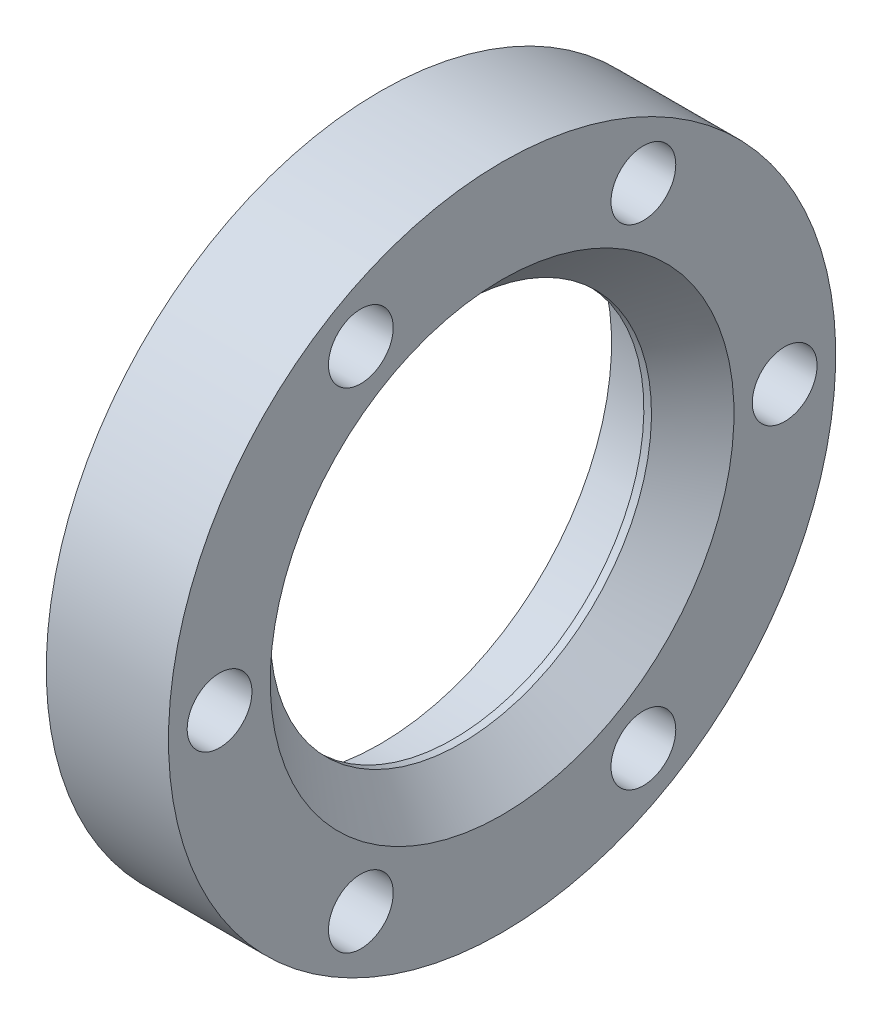
ISO-10303-21;
HEADER;
FILE_DESCRIPTION(('STEP AP214'),'2;1');
FILE_NAME('part.step','',(''),(''),'','','');
FILE_SCHEMA(('AUTOMOTIVE_DESIGN { 1 0 10303 214 1 1 1 1 }'));
ENDSEC;
DATA;
#1=APPLICATION_CONTEXT('core data for automotive mechanical design processes');
#2=APPLICATION_PROTOCOL_DEFINITION('international standard','automotive_design',2000,#1);
#3=PRODUCT_CONTEXT('',#1,'mechanical');
#4=PRODUCT('Part','Part','',(#3));
#5=PRODUCT_RELATED_PRODUCT_CATEGORY('part','',(#4));
#6=PRODUCT_DEFINITION_FORMATION('','',#4);
#7=PRODUCT_DEFINITION_CONTEXT('part definition',#1,'design');
#8=PRODUCT_DEFINITION('design','',#6,#7);
#9=PRODUCT_DEFINITION_SHAPE('','',#8);
#10=(LENGTH_UNIT() NAMED_UNIT(*) SI_UNIT(.MILLI.,.METRE.));
#11=(NAMED_UNIT(*) PLANE_ANGLE_UNIT() SI_UNIT($,.RADIAN.));
#12=(NAMED_UNIT(*) SI_UNIT($,.STERADIAN.) SOLID_ANGLE_UNIT());
#13=UNCERTAINTY_MEASURE_WITH_UNIT(LENGTH_MEASURE(1.E-05),#10,'distance_accuracy_value','');
#14=(GEOMETRIC_REPRESENTATION_CONTEXT(3) GLOBAL_UNCERTAINTY_ASSIGNED_CONTEXT((#13)) GLOBAL_UNIT_ASSIGNED_CONTEXT((#10,
#11,#12)) REPRESENTATION_CONTEXT('',''));
#15=CARTESIAN_POINT('',(0.,0.,0.));
#16=DIRECTION('',(0.,0.,1.));
#17=DIRECTION('',(1.,0.,0.));
#18=AXIS2_PLACEMENT_3D('',#15,#16,#17);
#19=CARTESIAN_POINT('',(8.01687499999896,0.,0.));
#20=DIRECTION('',(1.,0.,0.));
#21=DIRECTION('',(0.,1.,0.));
#22=AXIS2_PLACEMENT_3D('',#19,#20,#21);
#23=CYLINDRICAL_SURFACE('',#22,19.8120000000008);
#24=CARTESIAN_POINT('',(8.41374999807562,0.,0.));
#25=DIRECTION('',(1.,0.,0.));
#26=DIRECTION('',(0.,1.,0.));
#27=AXIS2_PLACEMENT_3D('',#24,#25,#26);
#28=CIRCLE('',#27,19.8120000019241);
#29=CARTESIAN_POINT('',(8.41374999807565,19.8120000019241,0.));
#30=VERTEX_POINT('',#29);
#31=EDGE_CURVE('E75',#30,#30,#28,.T.);
#32=ORIENTED_EDGE('',*,*,#31,.T.);
#33=EDGE_LOOP('',(#32));
#34=FACE_BOUND('',#33,.T.);
#35=CARTESIAN_POINT('',(7.61999999999895,0.,0.));
#36=DIRECTION('',(1.,0.,0.));
#37=DIRECTION('',(0.,1.,0.));
#38=AXIS2_PLACEMENT_3D('',#35,#36,#37);
#39=CIRCLE('',#38,19.8120000000008);
#40=CARTESIAN_POINT('',(7.61999999999898,19.8120000000008,0.));
#41=VERTEX_POINT('',#40);
#42=EDGE_CURVE('E18',#41,#41,#39,.T.);
#43=ORIENTED_EDGE('',*,*,#42,.F.);
#44=EDGE_LOOP('',(#43));
#45=FACE_BOUND('',#44,.T.);
#46=ADVANCED_FACE('F14',(#34,#45),#23,.F.);
#47=CARTESIAN_POINT('',(7.61999999999898,21.9437000000006,0.));
#48=DIRECTION('',(-1.,0.,0.));
#49=DIRECTION('',(0.,0.,1.));
#50=AXIS2_PLACEMENT_3D('',#47,#48,#49);
#51=PLANE('',#50);
#52=ORIENTED_EDGE('',*,*,#42,.T.);
#53=EDGE_LOOP('',(#52));
#54=FACE_BOUND('',#53,.T.);
#55=CARTESIAN_POINT('',(7.61999999999894,0.,0.));
#56=DIRECTION('',(1.,0.,0.));
#57=DIRECTION('',(0.,1.,0.));
#58=AXIS2_PLACEMENT_3D('',#55,#56,#57);
#59=CIRCLE('',#58,24.0754000000004);
#60=CARTESIAN_POINT('',(7.61999999999898,24.0754000000004,0.));
#61=VERTEX_POINT('',#60);
#62=EDGE_CURVE('E73',#61,#61,#59,.F.);
#63=ORIENTED_EDGE('',*,*,#62,.T.);
#64=EDGE_LOOP('',(#63));
#65=FACE_BOUND('',#64,.T.);
#66=ADVANCED_FACE('F84',(#54,#65),#51,.T.);
#67=CARTESIAN_POINT('',(12.7000000019235,0.,0.));
#68=DIRECTION('',(1.,0.,0.));
#69=DIRECTION('',(0.,1.,0.));
#70=AXIS2_PLACEMENT_3D('',#67,#68,#69);
#71=CONICAL_SURFACE('',#70,24.0982499980792,0.78539816250007);
#72=CARTESIAN_POINT('',(12.7000000019235,0.,0.));
#73=DIRECTION('',(1.,0.,0.));
#74=DIRECTION('',(0.,1.,0.));
#75=AXIS2_PLACEMENT_3D('',#72,#73,#74);
#76=CIRCLE('',#75,24.0982499980792);
#77=CARTESIAN_POINT('',(12.7000000019235,24.0982499980792,0.));
#78=VERTEX_POINT('',#77);
#79=EDGE_CURVE('E53',#78,#78,#76,.F.);
#80=ORIENTED_EDGE('',*,*,#79,.F.);
#81=EDGE_LOOP('',(#80));
#82=FACE_BOUND('',#81,.T.);
#83=ORIENTED_EDGE('',*,*,#31,.F.);
#84=EDGE_LOOP('',(#83));
#85=FACE_BOUND('',#84,.T.);
#86=ADVANCED_FACE('F94',(#82,#85),#71,.F.);
#87=CARTESIAN_POINT('',(1.240785174E-13,25.4285843160802,-14.6812));
#88=DIRECTION('',(1.,0.,0.));
#89=DIRECTION('',(0.,0.,-1.));
#90=AXIS2_PLACEMENT_3D('',#87,#88,#89);
#91=CYLINDRICAL_SURFACE('',#90,3.36549999999999);
#92=CARTESIAN_POINT('',(1.35358378E-13,25.4285843160802,-14.6812));
#93=DIRECTION('',(1.,0.,0.));
#94=DIRECTION('',(0.,0.,-1.));
#95=AXIS2_PLACEMENT_3D('',#92,#93,#94);
#96=CIRCLE('',#95,3.36549999999999);
#97=CARTESIAN_POINT('',(1.32693040020406E-13,25.4285843160802,-18.0467));
#98=VERTEX_POINT('',#97);
#99=EDGE_CURVE('E50',#98,#98,#96,.T.);
#100=ORIENTED_EDGE('',*,*,#99,.F.);
#101=EDGE_LOOP('',(#100));
#102=FACE_BOUND('',#101,.T.);
#103=CARTESIAN_POINT('',(12.7000000000002,25.4285843160802,-14.6812));
#104=DIRECTION('',(1.,0.,0.));
#105=DIRECTION('',(0.,0.,-1.));
#106=AXIS2_PLACEMENT_3D('',#103,#104,#105);
#107=CIRCLE('',#106,3.36549999999999);
#108=CARTESIAN_POINT('',(12.7000000000002,25.4285843160802,-18.0467));
#109=VERTEX_POINT('',#108);
#110=EDGE_CURVE('E71',#109,#109,#107,.F.);
#111=ORIENTED_EDGE('',*,*,#110,.F.);
#112=EDGE_LOOP('',(#111));
#113=FACE_BOUND('',#112,.T.);
#114=ADVANCED_FACE('F119',(#102,#113),#91,.F.);
#115=CARTESIAN_POINT('',(0.,0.,-29.3624));
#116=DIRECTION('',(1.,0.,0.));
#117=DIRECTION('',(0.,1.,0.));
#118=AXIS2_PLACEMENT_3D('',#115,#116,#117);
#119=CYLINDRICAL_SURFACE('',#118,3.3655);
#120=CARTESIAN_POINT('',(1.35358378E-13,0.,-29.3624));
#121=DIRECTION('',(1.,0.,0.));
#122=DIRECTION('',(0.,1.,0.));
#123=AXIS2_PLACEMENT_3D('',#120,#121,#122);
#124=CIRCLE('',#123,3.3655);
#125=CARTESIAN_POINT('',(1.414547082E-13,3.3655,-29.3624));
#126=VERTEX_POINT('',#125);
#127=EDGE_CURVE('E47',#126,#126,#124,.T.);
#128=ORIENTED_EDGE('',*,*,#127,.F.);
#129=EDGE_LOOP('',(#128));
#130=FACE_BOUND('',#129,.T.);
#131=CARTESIAN_POINT('',(12.7000000000002,0.,-29.3624));
#132=DIRECTION('',(1.,0.,0.));
#133=DIRECTION('',(0.,1.,0.));
#134=AXIS2_PLACEMENT_3D('',#131,#132,#133);
#135=CIRCLE('',#134,3.3655);
#136=CARTESIAN_POINT('',(12.7000000000002,3.36549999999998,-29.3624));
#137=VERTEX_POINT('',#136);
#138=EDGE_CURVE('E68',#137,#137,#135,.F.);
#139=ORIENTED_EDGE('',*,*,#138,.F.);
#140=EDGE_LOOP('',(#139));
#141=FACE_BOUND('',#140,.T.);
#142=ADVANCED_FACE('F125',(#130,#141),#119,.F.);
#143=CARTESIAN_POINT('',(0.,-25.4285843160802,-14.6812));
#144=DIRECTION('',(1.,0.,0.));
#145=DIRECTION('',(0.,0.,-1.));
#146=AXIS2_PLACEMENT_3D('',#143,#144,#145);
#147=CYLINDRICAL_SURFACE('',#146,3.36549999999999);
#148=CARTESIAN_POINT('',(1.35358378E-13,-25.4285843160802,-14.6812));
#149=DIRECTION('',(1.,0.,0.));
#150=DIRECTION('',(0.,0.,-1.));
#151=AXIS2_PLACEMENT_3D('',#148,#149,#150);
#152=CIRCLE('',#151,3.36549999999999);
#153=CARTESIAN_POINT('',(1.38023707180776E-13,-25.4285843160802,-18.0467));
#154=VERTEX_POINT('',#153);
#155=EDGE_CURVE('E44',#154,#154,#152,.T.);
#156=ORIENTED_EDGE('',*,*,#155,.F.);
#157=EDGE_LOOP('',(#156));
#158=FACE_BOUND('',#157,.T.);
#159=CARTESIAN_POINT('',(12.7000000000002,-25.4285843160802,-14.6812));
#160=DIRECTION('',(1.,0.,0.));
#161=DIRECTION('',(0.,0.,-1.));
#162=AXIS2_PLACEMENT_3D('',#159,#160,#161);
#163=CIRCLE('',#162,3.36549999999999);
#164=CARTESIAN_POINT('',(12.7000000000002,-25.4285843160802,-18.0467));
#165=VERTEX_POINT('',#164);
#166=EDGE_CURVE('E65',#165,#165,#163,.F.);
#167=ORIENTED_EDGE('',*,*,#166,.F.);
#168=EDGE_LOOP('',(#167));
#169=FACE_BOUND('',#168,.T.);
#170=ADVANCED_FACE('F146',(#158,#169),#147,.F.);
#171=CARTESIAN_POINT('',(0.,-25.4285843160802,14.6812));
#172=DIRECTION('',(1.,0.,0.));
#173=DIRECTION('',(0.,0.,-1.));
#174=AXIS2_PLACEMENT_3D('',#171,#172,#173);
#175=CYLINDRICAL_SURFACE('',#174,3.36549999999999);
#176=CARTESIAN_POINT('',(1.35358378E-13,-25.4285843160802,14.6812));
#177=DIRECTION('',(1.,0.,0.));
#178=DIRECTION('',(0.,0.,-1.));
#179=AXIS2_PLACEMENT_3D('',#176,#177,#178);
#180=CIRCLE('',#179,3.36549999999999);
#181=CARTESIAN_POINT('',(1.32795231693552E-13,-25.4285843160802,11.3157));
#182=VERTEX_POINT('',#181);
#183=EDGE_CURVE('E41',#182,#182,#180,.T.);
#184=ORIENTED_EDGE('',*,*,#183,.F.);
#185=EDGE_LOOP('',(#184));
#186=FACE_BOUND('',#185,.T.);
#187=CARTESIAN_POINT('',(12.7000000000002,-25.4285843160802,14.6812));
#188=DIRECTION('',(1.,0.,0.));
#189=DIRECTION('',(0.,0.,-1.));
#190=AXIS2_PLACEMENT_3D('',#187,#188,#189);
#191=CIRCLE('',#190,3.36549999999999);
#192=CARTESIAN_POINT('',(12.7000000000002,-25.4285843160802,11.3157));
#193=VERTEX_POINT('',#192);
#194=EDGE_CURVE('E62',#193,#193,#191,.F.);
#195=ORIENTED_EDGE('',*,*,#194,.F.);
#196=EDGE_LOOP('',(#195));
#197=FACE_BOUND('',#196,.T.);
#198=ADVANCED_FACE('F153',(#186,#197),#175,.F.);
#199=CARTESIAN_POINT('',(1.240785174E-13,25.4285843160802,14.6812));
#200=DIRECTION('',(1.,0.,0.));
#201=DIRECTION('',(0.,0.,-1.));
#202=AXIS2_PLACEMENT_3D('',#199,#200,#201);
#203=CYLINDRICAL_SURFACE('',#202,3.36549999999999);
#204=CARTESIAN_POINT('',(1.35358378E-13,25.4285843160802,14.6812));
#205=DIRECTION('',(1.,0.,0.));
#206=DIRECTION('',(0.,0.,-1.));
#207=AXIS2_PLACEMENT_3D('',#204,#205,#206);
#208=CIRCLE('',#207,3.36549999999999);
#209=CARTESIAN_POINT('',(1.37921517707334E-13,25.4285843160802,11.3157));
#210=VERTEX_POINT('',#209);
#211=EDGE_CURVE('E38',#210,#210,#208,.T.);
#212=ORIENTED_EDGE('',*,*,#211,.F.);
#213=EDGE_LOOP('',(#212));
#214=FACE_BOUND('',#213,.T.);
#215=CARTESIAN_POINT('',(12.7000000000002,25.4285843160802,14.6812));
#216=DIRECTION('',(1.,0.,0.));
#217=DIRECTION('',(0.,0.,-1.));
#218=AXIS2_PLACEMENT_3D('',#215,#216,#217);
#219=CIRCLE('',#218,3.36549999999999);
#220=CARTESIAN_POINT('',(12.7000000000002,25.4285843160802,11.3157));
#221=VERTEX_POINT('',#220);
#222=EDGE_CURVE('E59',#221,#221,#219,.F.);
#223=ORIENTED_EDGE('',*,*,#222,.F.);
#224=EDGE_LOOP('',(#223));
#225=FACE_BOUND('',#224,.T.);
#226=ADVANCED_FACE('F159',(#214,#225),#203,.F.);
#227=CARTESIAN_POINT('',(0.,0.,29.3624));
#228=DIRECTION('',(1.,0.,0.));
#229=DIRECTION('',(0.,1.,0.));
#230=AXIS2_PLACEMENT_3D('',#227,#228,#229);
#231=CYLINDRICAL_SURFACE('',#230,3.3655);
#232=CARTESIAN_POINT('',(1.35358378E-13,0.,29.3624));
#233=DIRECTION('',(1.,0.,0.));
#234=DIRECTION('',(0.,1.,0.));
#235=AXIS2_PLACEMENT_3D('',#232,#233,#234);
#236=CIRCLE('',#235,3.3655);
#237=CARTESIAN_POINT('',(1.413366998E-13,3.3655,29.3624));
#238=VERTEX_POINT('',#237);
#239=EDGE_CURVE('E35',#238,#238,#236,.T.);
#240=ORIENTED_EDGE('',*,*,#239,.F.);
#241=EDGE_LOOP('',(#240));
#242=FACE_BOUND('',#241,.T.);
#243=CARTESIAN_POINT('',(12.7000000000002,0.,29.3624));
#244=DIRECTION('',(1.,0.,0.));
#245=DIRECTION('',(0.,1.,0.));
#246=AXIS2_PLACEMENT_3D('',#243,#244,#245);
#247=CIRCLE('',#246,3.3655);
#248=CARTESIAN_POINT('',(12.7000000000002,3.36549999999998,29.3624));
#249=VERTEX_POINT('',#248);
#250=EDGE_CURVE('E56',#249,#249,#247,.F.);
#251=ORIENTED_EDGE('',*,*,#250,.F.);
#252=EDGE_LOOP('',(#251));
#253=FACE_BOUND('',#252,.T.);
#254=ADVANCED_FACE('F16',(#242,#253),#231,.F.);
#255=CARTESIAN_POINT('',(3.80999999999952,0.,0.));
#256=DIRECTION('',(1.,0.,0.));
#257=DIRECTION('',(0.,1.,0.));
#258=AXIS2_PLACEMENT_3D('',#255,#256,#257);
#259=CYLINDRICAL_SURFACE('',#258,24.0754000000004);
#260=ORIENTED_EDGE('',*,*,#62,.F.);
#261=EDGE_LOOP('',(#260));
#262=FACE_BOUND('',#261,.T.);
#263=CARTESIAN_POINT('',(0.,0.,0.));
#264=DIRECTION('',(1.,0.,0.));
#265=DIRECTION('',(0.,1.,0.));
#266=AXIS2_PLACEMENT_3D('',#263,#264,#265);
#267=CIRCLE('',#266,24.0754000000004);
#268=CARTESIAN_POINT('',(1.35140530413566E-13,24.0754000000004,0.));
#269=VERTEX_POINT('',#268);
#270=EDGE_CURVE('E27',#269,#269,#267,.T.);
#271=ORIENTED_EDGE('',*,*,#270,.F.);
#272=EDGE_LOOP('',(#271));
#273=FACE_BOUND('',#272,.T.);
#274=ADVANCED_FACE('F113',(#262,#273),#259,.F.);
#275=CARTESIAN_POINT('',(12.7000000000002,29.3846250000013,0.));
#276=DIRECTION('',(1.,0.,0.));
#277=DIRECTION('',(0.,0.,-1.));
#278=AXIS2_PLACEMENT_3D('',#275,#276,#277);
#279=PLANE('',#278);
#280=ORIENTED_EDGE('',*,*,#79,.T.);
#281=EDGE_LOOP('',(#280));
#282=FACE_BOUND('',#281,.T.);
#283=ORIENTED_EDGE('',*,*,#250,.T.);
#284=EDGE_LOOP('',(#283));
#285=FACE_BOUND('',#284,.T.);
#286=ORIENTED_EDGE('',*,*,#222,.T.);
#287=EDGE_LOOP('',(#286));
#288=FACE_BOUND('',#287,.T.);
#289=ORIENTED_EDGE('',*,*,#194,.T.);
#290=EDGE_LOOP('',(#289));
#291=FACE_BOUND('',#290,.T.);
#292=ORIENTED_EDGE('',*,*,#166,.T.);
#293=EDGE_LOOP('',(#292));
#294=FACE_BOUND('',#293,.T.);
#295=ORIENTED_EDGE('',*,*,#138,.T.);
#296=EDGE_LOOP('',(#295));
#297=FACE_BOUND('',#296,.T.);
#298=ORIENTED_EDGE('',*,*,#110,.T.);
#299=EDGE_LOOP('',(#298));
#300=FACE_BOUND('',#299,.T.);
#301=CARTESIAN_POINT('',(12.7000000000001,0.,0.));
#302=DIRECTION('',(1.,0.,0.));
#303=DIRECTION('',(0.,1.,0.));
#304=AXIS2_PLACEMENT_3D('',#301,#302,#303);
#305=CIRCLE('',#304,34.6710000000002);
#306=CARTESIAN_POINT('',(12.7000000000002,34.6710000000002,0.));
#307=VERTEX_POINT('',#306);
#308=EDGE_CURVE('E22',#307,#307,#305,.F.);
#309=ORIENTED_EDGE('',*,*,#308,.F.);
#310=EDGE_LOOP('',(#309));
#311=FACE_BOUND('',#310,.T.);
#312=ADVANCED_FACE('F106',(#282,#285,#288,#291,#294,#297,#300,#311),#279,.T.);
#313=CARTESIAN_POINT('',(1.35358378E-13,29.3732000000003,0.));
#314=DIRECTION('',(-1.,0.,0.));
#315=DIRECTION('',(0.,0.,1.));
#316=AXIS2_PLACEMENT_3D('',#313,#314,#315);
#317=PLANE('',#316);
#318=ORIENTED_EDGE('',*,*,#270,.T.);
#319=EDGE_LOOP('',(#318));
#320=FACE_BOUND('',#319,.T.);
#321=ORIENTED_EDGE('',*,*,#239,.T.);
#322=EDGE_LOOP('',(#321));
#323=FACE_BOUND('',#322,.T.);
#324=ORIENTED_EDGE('',*,*,#211,.T.);
#325=EDGE_LOOP('',(#324));
#326=FACE_BOUND('',#325,.T.);
#327=ORIENTED_EDGE('',*,*,#183,.T.);
#328=EDGE_LOOP('',(#327));
#329=FACE_BOUND('',#328,.T.);
#330=ORIENTED_EDGE('',*,*,#155,.T.);
#331=EDGE_LOOP('',(#330));
#332=FACE_BOUND('',#331,.T.);
#333=ORIENTED_EDGE('',*,*,#127,.T.);
#334=EDGE_LOOP('',(#333));
#335=FACE_BOUND('',#334,.T.);
#336=ORIENTED_EDGE('',*,*,#99,.T.);
#337=EDGE_LOOP('',(#336));
#338=FACE_BOUND('',#337,.T.);
#339=CARTESIAN_POINT('',(0.,0.,0.));
#340=DIRECTION('',(1.,0.,0.));
#341=DIRECTION('',(0.,1.,0.));
#342=AXIS2_PLACEMENT_3D('',#339,#340,#341);
#343=CIRCLE('',#342,34.6710000000002);
#344=CARTESIAN_POINT('',(1.35313821276015E-13,34.6710000000002,0.));
#345=VERTEX_POINT('',#344);
#346=EDGE_CURVE('E10',#345,#345,#343,.T.);
#347=ORIENTED_EDGE('',*,*,#346,.F.);
#348=EDGE_LOOP('',(#347));
#349=FACE_BOUND('',#348,.T.);
#350=ADVANCED_FACE('F99',(#320,#323,#326,#329,#332,#335,#338,#349),#317,.T.);
#351=CARTESIAN_POINT('',(6.3500000000001,0.,0.));
#352=DIRECTION('',(1.,0.,0.));
#353=DIRECTION('',(0.,1.,0.));
#354=AXIS2_PLACEMENT_3D('',#351,#352,#353);
#355=CYLINDRICAL_SURFACE('',#354,34.6710000000002);
#356=ORIENTED_EDGE('',*,*,#346,.T.);
#357=EDGE_LOOP('',(#356));
#358=FACE_BOUND('',#357,.T.);
#359=ORIENTED_EDGE('',*,*,#308,.T.);
#360=EDGE_LOOP('',(#359));
#361=FACE_BOUND('',#360,.T.);
#362=ADVANCED_FACE('F97',(#358,#361),#355,.T.);
#363=CLOSED_SHELL('',(#46,#66,#86,#114,#142,#170,#198,#226,#254,#274,#312,#350,#362));
#364=MANIFOLD_SOLID_BREP('B1',#363);
#365=ADVANCED_BREP_SHAPE_REPRESENTATION('',(#18,#364),#14);
#366=SHAPE_DEFINITION_REPRESENTATION(#9,#365);
ENDSEC;
END-ISO-10303-21;
